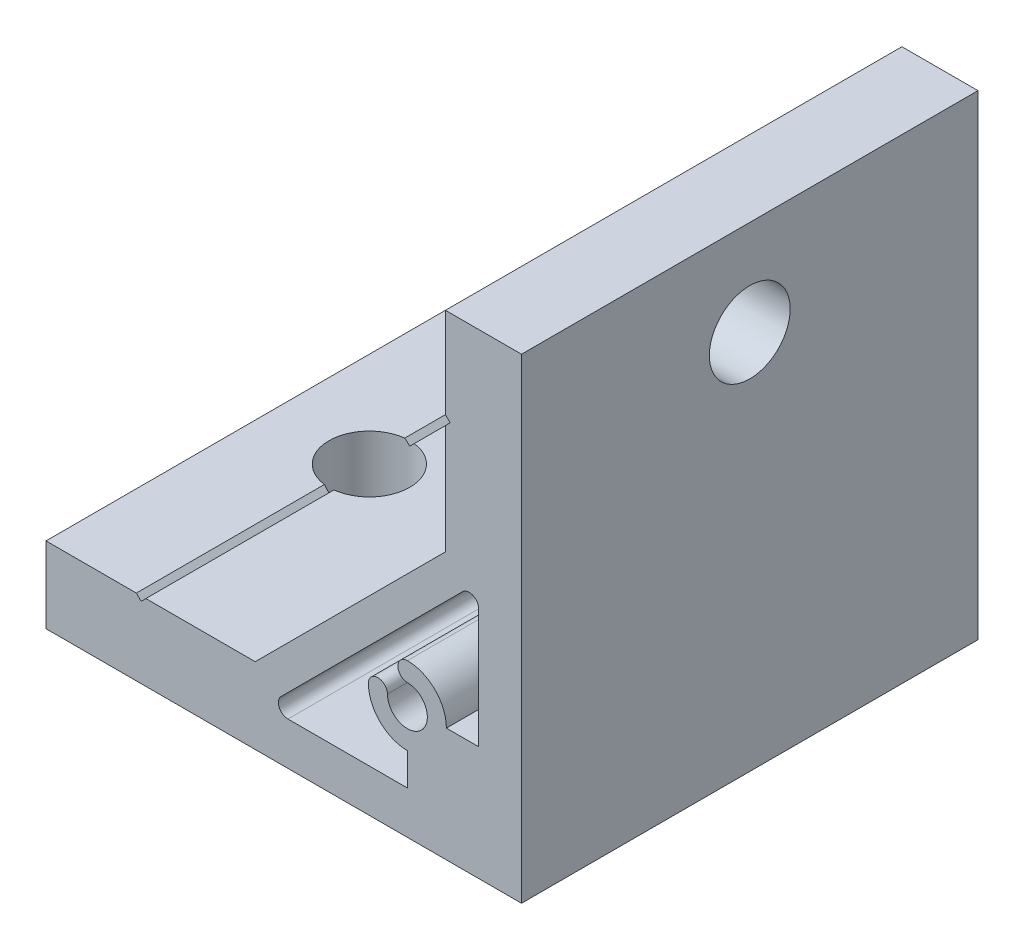
ISO-10303-21;
HEADER;
FILE_DESCRIPTION(('STEP AP214'),'2;1');
FILE_NAME('part.step','',(''),(''),'','','');
FILE_SCHEMA(('AUTOMOTIVE_DESIGN { 1 0 10303 214 1 1 1 1 }'));
ENDSEC;
DATA;
#1=APPLICATION_CONTEXT('core data for automotive mechanical design processes');
#2=APPLICATION_PROTOCOL_DEFINITION('international standard','automotive_design',2000,#1);
#3=PRODUCT_CONTEXT('',#1,'mechanical');
#4=PRODUCT('Part','Part','',(#3));
#5=PRODUCT_RELATED_PRODUCT_CATEGORY('part','',(#4));
#6=PRODUCT_DEFINITION_FORMATION('','',#4);
#7=PRODUCT_DEFINITION_CONTEXT('part definition',#1,'design');
#8=PRODUCT_DEFINITION('design','',#6,#7);
#9=PRODUCT_DEFINITION_SHAPE('','',#8);
#10=(LENGTH_UNIT() NAMED_UNIT(*) SI_UNIT(.MILLI.,.METRE.));
#11=(NAMED_UNIT(*) PLANE_ANGLE_UNIT() SI_UNIT($,.RADIAN.));
#12=(NAMED_UNIT(*) SI_UNIT($,.STERADIAN.) SOLID_ANGLE_UNIT());
#13=UNCERTAINTY_MEASURE_WITH_UNIT(LENGTH_MEASURE(1.E-05),#10,'distance_accuracy_value','');
#14=(GEOMETRIC_REPRESENTATION_CONTEXT(3) GLOBAL_UNCERTAINTY_ASSIGNED_CONTEXT((#13)) GLOBAL_UNIT_ASSIGNED_CONTEXT((#10,
#11,#12)) REPRESENTATION_CONTEXT('',''));
#15=CARTESIAN_POINT('',(0.,0.,0.));
#16=DIRECTION('',(0.,0.,1.));
#17=DIRECTION('',(1.,0.,0.));
#18=AXIS2_PLACEMENT_3D('',#15,#16,#17);
#19=CARTESIAN_POINT('',(-39.5,8.00000000000008,24.));
#20=DIRECTION('',(0.707106781186548,-0.707106781186548,0.));
#21=DIRECTION('',(0.707106781186548,0.707106781186548,0.));
#22=AXIS2_PLACEMENT_3D('',#19,#20,#21);
#23=PLANE('',#22);
#24=DIRECTION('',(0.,0.,-1.));
#25=VECTOR('',#24,1.);
#26=CARTESIAN_POINT('',(-39.5,8.00000000000008,24.));
#27=LINE('',#26,#25);
#28=CARTESIAN_POINT('',(-39.5,8.00000000000008,24.));
#29=VERTEX_POINT('',#28);
#30=CARTESIAN_POINT('',(-39.5,8.00000000000009,4.22048575403354));
#31=VERTEX_POINT('',#30);
#32=EDGE_CURVE('E264',#29,#31,#27,.T.);
#33=ORIENTED_EDGE('',*,*,#32,.T.);
#34=CARTESIAN_POINT('',(-40.,7.50000000000008,0.));
#35=DIRECTION('',(0.707106781186548,-0.707106781186548,0.));
#36=DIRECTION('',(0.707106781186548,0.707106781186548,0.));
#37=AXIS2_PLACEMENT_3D('',#34,#35,#36);
#38=ELLIPSE('',#37,6.01040764008561,4.25000000000001);
#39=CARTESIAN_POINT('',(-40.,7.50000000000008,4.25000000000002));
#40=VERTEX_POINT('',#39);
#41=EDGE_CURVE('E249',#31,#40,#38,.T.);
#42=ORIENTED_EDGE('',*,*,#41,.T.);
#43=DIRECTION('',(0.,0.,-1.));
#44=VECTOR('',#43,1.);
#45=CARTESIAN_POINT('',(-40.,7.50000000000008,24.));
#46=LINE('',#45,#44);
#47=CARTESIAN_POINT('',(-40.,7.50000000000008,24.));
#48=VERTEX_POINT('',#47);
#49=EDGE_CURVE('E248',#48,#40,#46,.T.);
#50=ORIENTED_EDGE('',*,*,#49,.F.);
#51=DIRECTION('',(-0.707106781186547,-0.707106781186547,0.));
#52=VECTOR('',#51,1.);
#53=CARTESIAN_POINT('',(-39.5,8.00000000000008,24.));
#54=LINE('',#53,#52);
#55=EDGE_CURVE('E365',#29,#48,#54,.T.);
#56=ORIENTED_EDGE('',*,*,#55,.F.);
#57=EDGE_LOOP('',(#33,#42,#50,#56));
#58=FACE_BOUND('',#57,.T.);
#59=ADVANCED_FACE('F34',(#58),#23,.F.);
#60=CARTESIAN_POINT('',(-40.,7.50000000000008,24.));
#61=DIRECTION('',(-0.707106781186549,-0.707106781186546,0.));
#62=DIRECTION('',(0.707106781186546,-0.707106781186549,0.));
#63=AXIS2_PLACEMENT_3D('',#60,#61,#62);
#64=PLANE('',#63);
#65=DIRECTION('',(0.,0.,-1.));
#66=VECTOR('',#65,1.);
#67=CARTESIAN_POINT('',(-40.5,8.00000000000008,24.));
#68=LINE('',#67,#66);
#69=CARTESIAN_POINT('',(-40.5,8.00000000000008,-4.22048575403354));
#70=VERTEX_POINT('',#69);
#71=CARTESIAN_POINT('',(-40.5,8.00000000000008,-24.));
#72=VERTEX_POINT('',#71);
#73=EDGE_CURVE('E256',#70,#72,#68,.T.);
#74=ORIENTED_EDGE('',*,*,#73,.F.);
#75=CARTESIAN_POINT('',(-40.,7.50000000000007,0.));
#76=DIRECTION('',(-0.707106781186549,-0.707106781186546,0.));
#77=DIRECTION('',(-0.707106781186546,0.707106781186549,0.));
#78=AXIS2_PLACEMENT_3D('',#75,#76,#77);
#79=ELLIPSE('',#78,6.01040764008572,4.25000000000001);
#80=CARTESIAN_POINT('',(-40.,7.50000000000008,-4.25));
#81=VERTEX_POINT('',#80);
#82=EDGE_CURVE('E49',#70,#81,#79,.T.);
#83=ORIENTED_EDGE('',*,*,#82,.T.);
#84=CARTESIAN_POINT('',(-40.,7.50000000000008,-24.));
#85=VERTEX_POINT('',#84);
#86=EDGE_CURVE('E255',#81,#85,#46,.T.);
#87=ORIENTED_EDGE('',*,*,#86,.T.);
#88=DIRECTION('',(-0.707106781186546,0.707106781186549,0.));
#89=VECTOR('',#88,1.);
#90=CARTESIAN_POINT('',(-40.,7.50000000000008,-24.));
#91=LINE('',#90,#89);
#92=EDGE_CURVE('E332',#85,#72,#91,.T.);
#93=ORIENTED_EDGE('',*,*,#92,.T.);
#94=EDGE_LOOP('',(#74,#83,#87,#93));
#95=FACE_BOUND('',#94,.T.);
#96=ADVANCED_FACE('F414',(#95),#64,.F.);
#97=CARTESIAN_POINT('',(-8.00000000000042,40.5,24.));
#98=DIRECTION('',(0.707106781186549,0.707106781186546,0.));
#99=DIRECTION('',(-0.707106781186546,0.707106781186549,0.));
#100=AXIS2_PLACEMENT_3D('',#97,#98,#99);
#101=PLANE('',#100);
#102=DIRECTION('',(0.,0.,-1.));
#103=VECTOR('',#102,1.);
#104=CARTESIAN_POINT('',(-8.00000000000042,40.5,24.));
#105=LINE('',#104,#103);
#106=CARTESIAN_POINT('',(-8.00000000000042,40.5,24.));
#107=VERTEX_POINT('',#106);
#108=CARTESIAN_POINT('',(-8.00000000000042,40.5,4.22048575403354));
#109=VERTEX_POINT('',#108);
#110=EDGE_CURVE('E282',#107,#109,#105,.T.);
#111=ORIENTED_EDGE('',*,*,#110,.T.);
#112=CARTESIAN_POINT('',(-7.50000000000042,40.,0.));
#113=DIRECTION('',(0.707106781186549,0.707106781186546,0.));
#114=DIRECTION('',(-0.707106781186546,0.707106781186549,0.));
#115=AXIS2_PLACEMENT_3D('',#112,#113,#114);
#116=ELLIPSE('',#115,6.01040764008586,4.25);
#117=CARTESIAN_POINT('',(-7.50000000000042,40.,4.25000000000001));
#118=VERTEX_POINT('',#117);
#119=EDGE_CURVE('E452',#109,#118,#116,.T.);
#120=ORIENTED_EDGE('',*,*,#119,.T.);
#121=DIRECTION('',(0.,0.,-1.));
#122=VECTOR('',#121,1.);
#123=CARTESIAN_POINT('',(-7.50000000000042,40.,24.));
#124=LINE('',#123,#122);
#125=CARTESIAN_POINT('',(-7.50000000000042,40.,24.));
#126=VERTEX_POINT('',#125);
#127=EDGE_CURVE('E278',#126,#118,#124,.T.);
#128=ORIENTED_EDGE('',*,*,#127,.F.);
#129=DIRECTION('',(0.707106781186546,-0.707106781186549,0.));
#130=VECTOR('',#129,1.);
#131=CARTESIAN_POINT('',(-8.00000000000042,40.5,24.));
#132=LINE('',#131,#130);
#133=EDGE_CURVE('E355',#107,#126,#132,.T.);
#134=ORIENTED_EDGE('',*,*,#133,.F.);
#135=EDGE_LOOP('',(#111,#120,#128,#134));
#136=FACE_BOUND('',#135,.T.);
#137=ADVANCED_FACE('F421',(#136),#101,.F.);
#138=CARTESIAN_POINT('',(-7.50000000000042,40.,24.));
#139=DIRECTION('',(0.707106781186549,-0.707106781186546,0.));
#140=DIRECTION('',(0.707106781186546,0.707106781186549,0.));
#141=AXIS2_PLACEMENT_3D('',#138,#139,#140);
#142=PLANE('',#141);
#143=DIRECTION('',(0.,0.,-1.));
#144=VECTOR('',#143,1.);
#145=CARTESIAN_POINT('',(-8.00000000000042,39.5,24.));
#146=LINE('',#145,#144);
#147=CARTESIAN_POINT('',(-8.00000000000042,39.5,-4.22048575403353));
#148=VERTEX_POINT('',#147);
#149=CARTESIAN_POINT('',(-8.00000000000042,39.5,-24.));
#150=VERTEX_POINT('',#149);
#151=EDGE_CURVE('E273',#148,#150,#146,.T.);
#152=ORIENTED_EDGE('',*,*,#151,.F.);
#153=CARTESIAN_POINT('',(-7.50000000000043,40.,0.));
#154=DIRECTION('',(0.707106781186549,-0.707106781186546,0.));
#155=DIRECTION('',(-0.707106781186546,-0.707106781186549,0.));
#156=AXIS2_PLACEMENT_3D('',#153,#154,#155);
#157=ELLIPSE('',#156,6.01040764008544,4.25);
#158=CARTESIAN_POINT('',(-7.50000000000042,40.,-4.24999999999999));
#159=VERTEX_POINT('',#158);
#160=EDGE_CURVE('E56',#148,#159,#157,.T.);
#161=ORIENTED_EDGE('',*,*,#160,.T.);
#162=CARTESIAN_POINT('',(-7.50000000000042,40.,-24.));
#163=VERTEX_POINT('',#162);
#164=EDGE_CURVE('E277',#159,#163,#124,.T.);
#165=ORIENTED_EDGE('',*,*,#164,.T.);
#166=DIRECTION('',(-0.707106781186546,-0.707106781186549,0.));
#167=VECTOR('',#166,1.);
#168=CARTESIAN_POINT('',(-7.50000000000042,40.,-24.));
#169=LINE('',#168,#167);
#170=EDGE_CURVE('E307',#163,#150,#169,.T.);
#171=ORIENTED_EDGE('',*,*,#170,.T.);
#172=EDGE_LOOP('',(#152,#161,#165,#171));
#173=FACE_BOUND('',#172,.T.);
#174=ADVANCED_FACE('F304',(#173),#142,.F.);
#175=CARTESIAN_POINT('',(0.,0.,24.));
#176=DIRECTION('',(0.,0.,1.));
#177=DIRECTION('',(1.,0.,0.));
#178=AXIS2_PLACEMENT_3D('',#175,#176,#177);
#179=PLANE('',#178);
#180=DIRECTION('',(0.,-1.,0.));
#181=VECTOR('',#180,1.);
#182=CARTESIAN_POINT('',(-50.,8.,24.));
#183=LINE('',#182,#181);
#184=CARTESIAN_POINT('',(-50.,8.,24.));
#185=VERTEX_POINT('',#184);
#186=CARTESIAN_POINT('',(-50.,0.,24.));
#187=VERTEX_POINT('',#186);
#188=EDGE_CURVE('E335',#185,#187,#183,.T.);
#189=ORIENTED_EDGE('',*,*,#188,.T.);
#190=DIRECTION('',(1.,0.,0.));
#191=VECTOR('',#190,1.);
#192=CARTESIAN_POINT('',(-50.,0.,24.));
#193=LINE('',#192,#191);
#194=CARTESIAN_POINT('',(0.,0.,24.));
#195=VERTEX_POINT('',#194);
#196=EDGE_CURVE('E339',#187,#195,#193,.T.);
#197=ORIENTED_EDGE('',*,*,#196,.T.);
#198=DIRECTION('',(0.,1.,0.));
#199=VECTOR('',#198,1.);
#200=CARTESIAN_POINT('',(0.,0.,24.));
#201=LINE('',#200,#199);
#202=CARTESIAN_POINT('',(0.,50.,24.));
#203=VERTEX_POINT('',#202);
#204=EDGE_CURVE('E344',#195,#203,#201,.T.);
#205=ORIENTED_EDGE('',*,*,#204,.T.);
#206=DIRECTION('',(-1.,0.,0.));
#207=VECTOR('',#206,1.);
#208=CARTESIAN_POINT('',(0.,50.,24.));
#209=LINE('',#208,#207);
#210=CARTESIAN_POINT('',(-8.00000000000009,50.,24.));
#211=VERTEX_POINT('',#210);
#212=EDGE_CURVE('E351',#203,#211,#209,.T.);
#213=ORIENTED_EDGE('',*,*,#212,.T.);
#214=DIRECTION('',(0.,-1.,0.));
#215=VECTOR('',#214,1.);
#216=CARTESIAN_POINT('',(-8.00000000000009,50.,24.));
#217=LINE('',#216,#215);
#218=EDGE_CURVE('E353',#211,#107,#217,.T.);
#219=ORIENTED_EDGE('',*,*,#218,.T.);
#220=ORIENTED_EDGE('',*,*,#133,.T.);
#221=DIRECTION('',(-0.707106781186546,-0.707106781186549,0.));
#222=VECTOR('',#221,1.);
#223=CARTESIAN_POINT('',(-7.50000000000042,40.,24.));
#224=LINE('',#223,#222);
#225=CARTESIAN_POINT('',(-8.00000000000042,39.5,24.));
#226=VERTEX_POINT('',#225);
#227=EDGE_CURVE('E357',#126,#226,#224,.T.);
#228=ORIENTED_EDGE('',*,*,#227,.T.);
#229=DIRECTION('',(0.,-1.,0.));
#230=VECTOR('',#229,1.);
#231=CARTESIAN_POINT('',(-8.00000000000042,39.5,24.));
#232=LINE('',#231,#230);
#233=CARTESIAN_POINT('',(-8.00000000000017,28.,24.));
#234=VERTEX_POINT('',#233);
#235=EDGE_CURVE('E359',#226,#234,#232,.T.);
#236=ORIENTED_EDGE('',*,*,#235,.T.);
#237=DIRECTION('',(-0.707106781186546,-0.707106781186549,0.));
#238=VECTOR('',#237,1.);
#239=CARTESIAN_POINT('',(-8.00000000000017,28.,24.));
#240=LINE('',#239,#238);
#241=CARTESIAN_POINT('',(-28.,8.00000000000008,24.));
#242=VERTEX_POINT('',#241);
#243=EDGE_CURVE('E361',#234,#242,#240,.T.);
#244=ORIENTED_EDGE('',*,*,#243,.T.);
#245=DIRECTION('',(-1.,0.,0.));
#246=VECTOR('',#245,1.);
#247=CARTESIAN_POINT('',(-28.,8.00000000000008,24.));
#248=LINE('',#247,#246);
#249=EDGE_CURVE('E363',#242,#29,#248,.T.);
#250=ORIENTED_EDGE('',*,*,#249,.T.);
#251=ORIENTED_EDGE('',*,*,#55,.T.);
#252=DIRECTION('',(-0.707106781186546,0.707106781186549,0.));
#253=VECTOR('',#252,1.);
#254=CARTESIAN_POINT('',(-40.,7.50000000000008,24.));
#255=LINE('',#254,#253);
#256=CARTESIAN_POINT('',(-40.5,8.00000000000008,24.));
#257=VERTEX_POINT('',#256);
#258=EDGE_CURVE('E367',#48,#257,#255,.T.);
#259=ORIENTED_EDGE('',*,*,#258,.T.);
#260=DIRECTION('',(-1.,0.,0.));
#261=VECTOR('',#260,1.);
#262=CARTESIAN_POINT('',(-40.5,8.00000000000008,24.));
#263=LINE('',#262,#261);
#264=EDGE_CURVE('E254',#257,#185,#263,.T.);
#265=ORIENTED_EDGE('',*,*,#264,.T.);
#266=EDGE_LOOP('',(#189,#197,#205,#213,#219,#220,#228,#236,#244,#250,#251,#259,#265));
#267=FACE_BOUND('',#266,.T.);
#268=DIRECTION('',(0.,1.,0.));
#269=VECTOR('',#268,1.);
#270=CARTESIAN_POINT('',(-4.5,12.,24.));
#271=LINE('',#270,#269);
#272=CARTESIAN_POINT('',(-4.5,12.,24.));
#273=VERTEX_POINT('',#272);
#274=CARTESIAN_POINT('',(-4.5,24.5603030380332,24.));
#275=VERTEX_POINT('',#274);
#276=EDGE_CURVE('E458',#273,#275,#271,.T.);
#277=ORIENTED_EDGE('',*,*,#276,.F.);
#278=DIRECTION('',(1.,0.,0.));
#279=VECTOR('',#278,1.);
#280=CARTESIAN_POINT('',(-7.9,12.,24.));
#281=LINE('',#280,#279);
#282=CARTESIAN_POINT('',(-7.9,12.,24.));
#283=VERTEX_POINT('',#282);
#284=EDGE_CURVE('E456',#283,#273,#281,.T.);
#285=ORIENTED_EDGE('',*,*,#284,.F.);
#286=CARTESIAN_POINT('',(-12.,12.,24.));
#287=DIRECTION('',(0.,0.,-1.));
#288=DIRECTION('',(-1.,0.,0.));
#289=AXIS2_PLACEMENT_3D('',#286,#287,#288);
#290=CIRCLE('',#289,4.1);
#291=CARTESIAN_POINT('',(-12.,16.1,24.));
#292=VERTEX_POINT('',#291);
#293=EDGE_CURVE('E480',#292,#283,#290,.T.);
#294=ORIENTED_EDGE('',*,*,#293,.F.);
#295=CARTESIAN_POINT('',(-12.,15.1,24.));
#296=DIRECTION('',(0.,0.,-1.));
#297=DIRECTION('',(-1.,0.,0.));
#298=AXIS2_PLACEMENT_3D('',#295,#296,#297);
#299=CIRCLE('',#298,1.);
#300=CARTESIAN_POINT('',(-12.,14.1,24.));
#301=VERTEX_POINT('',#300);
#302=EDGE_CURVE('E477',#301,#292,#299,.T.);
#303=ORIENTED_EDGE('',*,*,#302,.F.);
#304=CARTESIAN_POINT('',(-12.,12.,24.));
#305=DIRECTION('',(0.,0.,1.));
#306=DIRECTION('',(1.,0.,0.));
#307=AXIS2_PLACEMENT_3D('',#304,#305,#306);
#308=CIRCLE('',#307,2.1);
#309=CARTESIAN_POINT('',(-14.1,12.,24.));
#310=VERTEX_POINT('',#309);
#311=EDGE_CURVE('E475',#310,#301,#308,.T.);
#312=ORIENTED_EDGE('',*,*,#311,.F.);
#313=CARTESIAN_POINT('',(-15.1,12.,24.));
#314=DIRECTION('',(0.,0.,-1.));
#315=DIRECTION('',(-1.,0.,0.));
#316=AXIS2_PLACEMENT_3D('',#313,#314,#315);
#317=CIRCLE('',#316,1.);
#318=CARTESIAN_POINT('',(-16.1,12.,24.));
#319=VERTEX_POINT('',#318);
#320=EDGE_CURVE('E473',#319,#310,#317,.T.);
#321=ORIENTED_EDGE('',*,*,#320,.F.);
#322=CARTESIAN_POINT('',(-12.,12.,24.));
#323=DIRECTION('',(0.,0.,-1.));
#324=DIRECTION('',(-1.,0.,0.));
#325=AXIS2_PLACEMENT_3D('',#322,#323,#324);
#326=CIRCLE('',#325,4.1);
#327=CARTESIAN_POINT('',(-12.,7.9,24.));
#328=VERTEX_POINT('',#327);
#329=EDGE_CURVE('E471',#328,#319,#326,.T.);
#330=ORIENTED_EDGE('',*,*,#329,.F.);
#331=DIRECTION('',(0.,1.,0.));
#332=VECTOR('',#331,1.);
#333=CARTESIAN_POINT('',(-12.,4.5,24.));
#334=LINE('',#333,#332);
#335=CARTESIAN_POINT('',(-12.,4.5,24.));
#336=VERTEX_POINT('',#335);
#337=EDGE_CURVE('E469',#336,#328,#334,.T.);
#338=ORIENTED_EDGE('',*,*,#337,.F.);
#339=DIRECTION('',(1.,0.,0.));
#340=VECTOR('',#339,1.);
#341=CARTESIAN_POINT('',(-24.5603030380331,4.5,24.));
#342=LINE('',#341,#340);
#343=CARTESIAN_POINT('',(-24.5603030380331,4.5,24.));
#344=VERTEX_POINT('',#343);
#345=EDGE_CURVE('E467',#344,#336,#342,.T.);
#346=ORIENTED_EDGE('',*,*,#345,.F.);
#347=CARTESIAN_POINT('',(-24.5603030380331,5.5,24.));
#348=DIRECTION('',(0.,0.,1.));
#349=DIRECTION('',(1.,0.,0.));
#350=AXIS2_PLACEMENT_3D('',#347,#348,#349);
#351=CIRCLE('',#350,1.);
#352=CARTESIAN_POINT('',(-25.2674098192196,6.20710678118655,24.));
#353=VERTEX_POINT('',#352);
#354=EDGE_CURVE('E465',#353,#344,#351,.T.);
#355=ORIENTED_EDGE('',*,*,#354,.F.);
#356=DIRECTION('',(-0.707106781186546,-0.707106781186549,0.));
#357=VECTOR('',#356,1.);
#358=CARTESIAN_POINT('',(-6.20710678118655,25.2674098192197,24.));
#359=LINE('',#358,#357);
#360=CARTESIAN_POINT('',(-6.20710678118655,25.2674098192197,24.));
#361=VERTEX_POINT('',#360);
#362=EDGE_CURVE('E463',#361,#353,#359,.T.);
#363=ORIENTED_EDGE('',*,*,#362,.F.);
#364=CARTESIAN_POINT('',(-5.5,24.5603030380332,24.));
#365=DIRECTION('',(0.,0.,1.));
#366=DIRECTION('',(1.,0.,0.));
#367=AXIS2_PLACEMENT_3D('',#364,#365,#366);
#368=CIRCLE('',#367,0.999999999999999);
#369=EDGE_CURVE('E461',#275,#361,#368,.T.);
#370=ORIENTED_EDGE('',*,*,#369,.F.);
#371=EDGE_LOOP('',(#277,#285,#294,#303,#312,#321,#330,#338,#346,#355,#363,#370));
#372=FACE_BOUND('',#371,.T.);
#373=ADVANCED_FACE('F411',(#267,#372),#179,.T.);
#374=CARTESIAN_POINT('',(0.,0.,-24.));
#375=DIRECTION('',(0.,0.,1.));
#376=DIRECTION('',(1.,0.,0.));
#377=AXIS2_PLACEMENT_3D('',#374,#375,#376);
#378=PLANE('',#377);
#379=DIRECTION('',(0.,-1.,0.));
#380=VECTOR('',#379,1.);
#381=CARTESIAN_POINT('',(-50.,8.,-24.));
#382=LINE('',#381,#380);
#383=CARTESIAN_POINT('',(-50.,8.,-24.));
#384=VERTEX_POINT('',#383);
#385=CARTESIAN_POINT('',(-50.,0.,-24.));
#386=VERTEX_POINT('',#385);
#387=EDGE_CURVE('E370',#384,#386,#382,.T.);
#388=ORIENTED_EDGE('',*,*,#387,.F.);
#389=DIRECTION('',(-1.,0.,0.));
#390=VECTOR('',#389,1.);
#391=CARTESIAN_POINT('',(-40.5,8.00000000000008,-24.));
#392=LINE('',#391,#390);
#393=EDGE_CURVE('E334',#72,#384,#392,.T.);
#394=ORIENTED_EDGE('',*,*,#393,.F.);
#395=ORIENTED_EDGE('',*,*,#92,.F.);
#396=DIRECTION('',(-0.707106781186547,-0.707106781186547,0.));
#397=VECTOR('',#396,1.);
#398=CARTESIAN_POINT('',(-39.5,8.00000000000008,-24.));
#399=LINE('',#398,#397);
#400=CARTESIAN_POINT('',(-39.5,8.00000000000008,-24.));
#401=VERTEX_POINT('',#400);
#402=EDGE_CURVE('E329',#401,#85,#399,.T.);
#403=ORIENTED_EDGE('',*,*,#402,.F.);
#404=DIRECTION('',(-1.,0.,0.));
#405=VECTOR('',#404,1.);
#406=CARTESIAN_POINT('',(-28.,8.00000000000008,-24.));
#407=LINE('',#406,#405);
#408=CARTESIAN_POINT('',(-28.,8.00000000000008,-24.));
#409=VERTEX_POINT('',#408);
#410=EDGE_CURVE('E323',#409,#401,#407,.T.);
#411=ORIENTED_EDGE('',*,*,#410,.F.);
#412=DIRECTION('',(-0.707106781186546,-0.707106781186549,0.));
#413=VECTOR('',#412,1.);
#414=CARTESIAN_POINT('',(-8.00000000000017,28.,-24.));
#415=LINE('',#414,#413);
#416=CARTESIAN_POINT('',(-8.00000000000017,28.,-24.));
#417=VERTEX_POINT('',#416);
#418=EDGE_CURVE('E320',#417,#409,#415,.T.);
#419=ORIENTED_EDGE('',*,*,#418,.F.);
#420=DIRECTION('',(0.,-1.,0.));
#421=VECTOR('',#420,1.);
#422=CARTESIAN_POINT('',(-8.00000000000042,39.5,-24.));
#423=LINE('',#422,#421);
#424=EDGE_CURVE('E312',#150,#417,#423,.T.);
#425=ORIENTED_EDGE('',*,*,#424,.F.);
#426=ORIENTED_EDGE('',*,*,#170,.F.);
#427=DIRECTION('',(0.707106781186546,-0.707106781186549,0.));
#428=VECTOR('',#427,1.);
#429=CARTESIAN_POINT('',(-8.00000000000042,40.5,-24.));
#430=LINE('',#429,#428);
#431=CARTESIAN_POINT('',(-8.00000000000042,40.5,-24.));
#432=VERTEX_POINT('',#431);
#433=EDGE_CURVE('E313',#432,#163,#430,.T.);
#434=ORIENTED_EDGE('',*,*,#433,.F.);
#435=DIRECTION('',(0.,-1.,0.));
#436=VECTOR('',#435,1.);
#437=CARTESIAN_POINT('',(-8.00000000000009,50.,-24.));
#438=LINE('',#437,#436);
#439=CARTESIAN_POINT('',(-8.00000000000009,50.,-24.));
#440=VERTEX_POINT('',#439);
#441=EDGE_CURVE('E379',#440,#432,#438,.T.);
#442=ORIENTED_EDGE('',*,*,#441,.F.);
#443=DIRECTION('',(-1.,0.,0.));
#444=VECTOR('',#443,1.);
#445=CARTESIAN_POINT('',(0.,50.,-24.));
#446=LINE('',#445,#444);
#447=CARTESIAN_POINT('',(0.,50.,-24.));
#448=VERTEX_POINT('',#447);
#449=EDGE_CURVE('E377',#448,#440,#446,.T.);
#450=ORIENTED_EDGE('',*,*,#449,.F.);
#451=DIRECTION('',(0.,1.,0.));
#452=VECTOR('',#451,1.);
#453=CARTESIAN_POINT('',(0.,0.,-24.));
#454=LINE('',#453,#452);
#455=CARTESIAN_POINT('',(0.,0.,-24.));
#456=VERTEX_POINT('',#455);
#457=EDGE_CURVE('E375',#456,#448,#454,.T.);
#458=ORIENTED_EDGE('',*,*,#457,.F.);
#459=DIRECTION('',(1.,0.,0.));
#460=VECTOR('',#459,1.);
#461=CARTESIAN_POINT('',(-50.,0.,-24.));
#462=LINE('',#461,#460);
#463=EDGE_CURVE('E373',#386,#456,#462,.T.);
#464=ORIENTED_EDGE('',*,*,#463,.F.);
#465=EDGE_LOOP('',(#388,#394,#395,#403,#411,#419,#425,#426,#434,#442,#450,#458,#464));
#466=FACE_BOUND('',#465,.T.);
#467=DIRECTION('',(1.,0.,0.));
#468=VECTOR('',#467,1.);
#469=CARTESIAN_POINT('',(-7.9,12.,-24.));
#470=LINE('',#469,#468);
#471=CARTESIAN_POINT('',(-7.9,12.,-24.));
#472=VERTEX_POINT('',#471);
#473=CARTESIAN_POINT('',(-4.5,12.,-24.));
#474=VERTEX_POINT('',#473);
#475=EDGE_CURVE('E483',#472,#474,#470,.T.);
#476=ORIENTED_EDGE('',*,*,#475,.T.);
#477=DIRECTION('',(0.,1.,0.));
#478=VECTOR('',#477,1.);
#479=CARTESIAN_POINT('',(-4.5,12.,-24.));
#480=LINE('',#479,#478);
#481=CARTESIAN_POINT('',(-4.5,24.5603030380332,-24.));
#482=VERTEX_POINT('',#481);
#483=EDGE_CURVE('E486',#474,#482,#480,.T.);
#484=ORIENTED_EDGE('',*,*,#483,.T.);
#485=CARTESIAN_POINT('',(-5.5,24.5603030380332,-24.));
#486=DIRECTION('',(0.,0.,1.));
#487=DIRECTION('',(1.,0.,0.));
#488=AXIS2_PLACEMENT_3D('',#485,#486,#487);
#489=CIRCLE('',#488,0.999999999999999);
#490=CARTESIAN_POINT('',(-6.20710678118655,25.2674098192197,-24.));
#491=VERTEX_POINT('',#490);
#492=EDGE_CURVE('E489',#482,#491,#489,.T.);
#493=ORIENTED_EDGE('',*,*,#492,.T.);
#494=DIRECTION('',(-0.707106781186546,-0.707106781186549,0.));
#495=VECTOR('',#494,1.);
#496=CARTESIAN_POINT('',(-6.20710678118655,25.2674098192197,-24.));
#497=LINE('',#496,#495);
#498=CARTESIAN_POINT('',(-25.2674098192196,6.20710678118655,-24.));
#499=VERTEX_POINT('',#498);
#500=EDGE_CURVE('E492',#491,#499,#497,.T.);
#501=ORIENTED_EDGE('',*,*,#500,.T.);
#502=CARTESIAN_POINT('',(-24.5603030380331,5.5,-24.));
#503=DIRECTION('',(0.,0.,1.));
#504=DIRECTION('',(1.,0.,0.));
#505=AXIS2_PLACEMENT_3D('',#502,#503,#504);
#506=CIRCLE('',#505,1.);
#507=CARTESIAN_POINT('',(-24.5603030380331,4.5,-24.));
#508=VERTEX_POINT('',#507);
#509=EDGE_CURVE('E495',#499,#508,#506,.T.);
#510=ORIENTED_EDGE('',*,*,#509,.T.);
#511=DIRECTION('',(1.,0.,0.));
#512=VECTOR('',#511,1.);
#513=CARTESIAN_POINT('',(-24.5603030380331,4.5,-24.));
#514=LINE('',#513,#512);
#515=CARTESIAN_POINT('',(-12.,4.5,-24.));
#516=VERTEX_POINT('',#515);
#517=EDGE_CURVE('E498',#508,#516,#514,.T.);
#518=ORIENTED_EDGE('',*,*,#517,.T.);
#519=DIRECTION('',(0.,1.,0.));
#520=VECTOR('',#519,1.);
#521=CARTESIAN_POINT('',(-12.,4.5,-24.));
#522=LINE('',#521,#520);
#523=CARTESIAN_POINT('',(-12.,7.9,-24.));
#524=VERTEX_POINT('',#523);
#525=EDGE_CURVE('E501',#516,#524,#522,.T.);
#526=ORIENTED_EDGE('',*,*,#525,.T.);
#527=CARTESIAN_POINT('',(-12.,12.,-24.));
#528=DIRECTION('',(0.,0.,-1.));
#529=DIRECTION('',(-1.,0.,0.));
#530=AXIS2_PLACEMENT_3D('',#527,#528,#529);
#531=CIRCLE('',#530,4.1);
#532=CARTESIAN_POINT('',(-16.1,12.,-24.));
#533=VERTEX_POINT('',#532);
#534=EDGE_CURVE('E504',#524,#533,#531,.T.);
#535=ORIENTED_EDGE('',*,*,#534,.T.);
#536=CARTESIAN_POINT('',(-15.1,12.,-24.));
#537=DIRECTION('',(0.,0.,-1.));
#538=DIRECTION('',(-1.,0.,0.));
#539=AXIS2_PLACEMENT_3D('',#536,#537,#538);
#540=CIRCLE('',#539,1.);
#541=CARTESIAN_POINT('',(-14.1,12.,-24.));
#542=VERTEX_POINT('',#541);
#543=EDGE_CURVE('E507',#533,#542,#540,.T.);
#544=ORIENTED_EDGE('',*,*,#543,.T.);
#545=CARTESIAN_POINT('',(-12.,12.,-24.));
#546=DIRECTION('',(0.,0.,1.));
#547=DIRECTION('',(1.,0.,0.));
#548=AXIS2_PLACEMENT_3D('',#545,#546,#547);
#549=CIRCLE('',#548,2.1);
#550=CARTESIAN_POINT('',(-12.,14.1,-24.));
#551=VERTEX_POINT('',#550);
#552=EDGE_CURVE('E510',#542,#551,#549,.T.);
#553=ORIENTED_EDGE('',*,*,#552,.T.);
#554=CARTESIAN_POINT('',(-12.,15.1,-24.));
#555=DIRECTION('',(0.,0.,-1.));
#556=DIRECTION('',(-1.,0.,0.));
#557=AXIS2_PLACEMENT_3D('',#554,#555,#556);
#558=CIRCLE('',#557,1.);
#559=CARTESIAN_POINT('',(-12.,16.1,-24.));
#560=VERTEX_POINT('',#559);
#561=EDGE_CURVE('E513',#551,#560,#558,.T.);
#562=ORIENTED_EDGE('',*,*,#561,.T.);
#563=CARTESIAN_POINT('',(-12.,12.,-24.));
#564=DIRECTION('',(0.,0.,-1.));
#565=DIRECTION('',(-1.,0.,0.));
#566=AXIS2_PLACEMENT_3D('',#563,#564,#565);
#567=CIRCLE('',#566,4.1);
#568=EDGE_CURVE('E459',#560,#472,#567,.T.);
#569=ORIENTED_EDGE('',*,*,#568,.T.);
#570=EDGE_LOOP('',(#476,#484,#493,#501,#510,#518,#526,#535,#544,#553,#562,#569));
#571=FACE_BOUND('',#570,.T.);
#572=ADVANCED_FACE('F317',(#466,#571),#378,.F.);
#573=CARTESIAN_POINT('',(-50.,8.,24.));
#574=DIRECTION('',(1.,0.,0.));
#575=DIRECTION('',(0.,1.,0.));
#576=AXIS2_PLACEMENT_3D('',#573,#574,#575);
#577=PLANE('',#576);
#578=ORIENTED_EDGE('',*,*,#387,.T.);
#579=DIRECTION('',(0.,0.,-1.));
#580=VECTOR('',#579,1.);
#581=CARTESIAN_POINT('',(-50.,0.,24.));
#582=LINE('',#581,#580);
#583=EDGE_CURVE('E294',#187,#386,#582,.T.);
#584=ORIENTED_EDGE('',*,*,#583,.F.);
#585=ORIENTED_EDGE('',*,*,#188,.F.);
#586=DIRECTION('',(0.,0.,-1.));
#587=VECTOR('',#586,1.);
#588=CARTESIAN_POINT('',(-50.,8.,24.));
#589=LINE('',#588,#587);
#590=EDGE_CURVE('E259',#185,#384,#589,.T.);
#591=ORIENTED_EDGE('',*,*,#590,.T.);
#592=EDGE_LOOP('',(#578,#584,#585,#591));
#593=FACE_BOUND('',#592,.T.);
#594=ADVANCED_FACE('F36',(#593),#577,.F.);
#595=CARTESIAN_POINT('',(-50.,0.,24.));
#596=DIRECTION('',(0.,1.,0.));
#597=DIRECTION('',(-1.,0.,0.));
#598=AXIS2_PLACEMENT_3D('',#595,#596,#597);
#599=PLANE('',#598);
#600=CARTESIAN_POINT('',(-40.,-3.29597460435593E-13,0.));
#601=DIRECTION('',(0.,1.,0.));
#602=DIRECTION('',(-1.,0.,0.));
#603=AXIS2_PLACEMENT_3D('',#600,#601,#602);
#604=CIRCLE('',#603,4.25000000000001);
#605=CARTESIAN_POINT('',(-44.25,-3.64520183044074E-13,0.));
#606=VERTEX_POINT('',#605);
#607=EDGE_CURVE('E250',#606,#606,#604,.T.);
#608=ORIENTED_EDGE('',*,*,#607,.T.);
#609=EDGE_LOOP('',(#608));
#610=FACE_BOUND('',#609,.T.);
#611=ORIENTED_EDGE('',*,*,#463,.T.);
#612=DIRECTION('',(0.,0.,-1.));
#613=VECTOR('',#612,1.);
#614=CARTESIAN_POINT('',(0.,0.,24.));
#615=LINE('',#614,#613);
#616=EDGE_CURVE('E291',#195,#456,#615,.T.);
#617=ORIENTED_EDGE('',*,*,#616,.F.);
#618=ORIENTED_EDGE('',*,*,#196,.F.);
#619=ORIENTED_EDGE('',*,*,#583,.T.);
#620=EDGE_LOOP('',(#611,#617,#618,#619));
#621=FACE_BOUND('',#620,.T.);
#622=ADVANCED_FACE('F403',(#610,#621),#599,.F.);
#623=CARTESIAN_POINT('',(0.,0.,24.));
#624=DIRECTION('',(-1.,0.,0.));
#625=DIRECTION('',(0.,0.,1.));
#626=AXIS2_PLACEMENT_3D('',#623,#624,#625);
#627=PLANE('',#626);
#628=CARTESIAN_POINT('',(1.38777878078145E-12,39.9999999999998,0.));
#629=DIRECTION('',(-1.,0.,0.));
#630=DIRECTION('',(0.,-1.,0.));
#631=AXIS2_PLACEMENT_3D('',#628,#629,#630);
#632=CIRCLE('',#631,4.25);
#633=CARTESIAN_POINT('',(1.24032728532342E-12,35.7499999999998,0.));
#634=VERTEX_POINT('',#633);
#635=EDGE_CURVE('E446',#634,#634,#632,.T.);
#636=ORIENTED_EDGE('',*,*,#635,.T.);
#637=EDGE_LOOP('',(#636));
#638=FACE_BOUND('',#637,.T.);
#639=ORIENTED_EDGE('',*,*,#457,.T.);
#640=DIRECTION('',(0.,0.,-1.));
#641=VECTOR('',#640,1.);
#642=CARTESIAN_POINT('',(0.,50.,24.));
#643=LINE('',#642,#641);
#644=EDGE_CURVE('E288',#203,#448,#643,.T.);
#645=ORIENTED_EDGE('',*,*,#644,.F.);
#646=ORIENTED_EDGE('',*,*,#204,.F.);
#647=ORIENTED_EDGE('',*,*,#616,.T.);
#648=EDGE_LOOP('',(#639,#645,#646,#647));
#649=FACE_BOUND('',#648,.T.);
#650=ADVANCED_FACE('F400',(#638,#649),#627,.F.);
#651=CARTESIAN_POINT('',(0.,50.,24.));
#652=DIRECTION('',(0.,-1.,0.));
#653=DIRECTION('',(0.,0.,-1.));
#654=AXIS2_PLACEMENT_3D('',#651,#652,#653);
#655=PLANE('',#654);
#656=ORIENTED_EDGE('',*,*,#449,.T.);
#657=DIRECTION('',(0.,0.,-1.));
#658=VECTOR('',#657,1.);
#659=CARTESIAN_POINT('',(-8.00000000000009,50.,24.));
#660=LINE('',#659,#658);
#661=EDGE_CURVE('E285',#211,#440,#660,.T.);
#662=ORIENTED_EDGE('',*,*,#661,.F.);
#663=ORIENTED_EDGE('',*,*,#212,.F.);
#664=ORIENTED_EDGE('',*,*,#644,.T.);
#665=EDGE_LOOP('',(#656,#662,#663,#664));
#666=FACE_BOUND('',#665,.T.);
#667=ADVANCED_FACE('F396',(#666),#655,.F.);
#668=CARTESIAN_POINT('',(-8.00000000000009,50.,24.));
#669=DIRECTION('',(1.,0.,0.));
#670=DIRECTION('',(0.,1.,0.));
#671=AXIS2_PLACEMENT_3D('',#668,#669,#670);
#672=PLANE('',#671);
#673=CARTESIAN_POINT('',(-8.00000000000042,40.5,-4.22048575403354));
#674=VERTEX_POINT('',#673);
#675=EDGE_CURVE('E281',#674,#432,#105,.T.);
#676=ORIENTED_EDGE('',*,*,#675,.F.);
#677=CARTESIAN_POINT('',(-8.00000000000044,40.0000000000001,0.));
#678=DIRECTION('',(-1.,0.,0.));
#679=DIRECTION('',(0.,-1.,0.));
#680=AXIS2_PLACEMENT_3D('',#677,#678,#679);
#681=CIRCLE('',#680,4.25);
#682=EDGE_CURVE('E440',#109,#674,#681,.T.);
#683=ORIENTED_EDGE('',*,*,#682,.F.);
#684=ORIENTED_EDGE('',*,*,#110,.F.);
#685=ORIENTED_EDGE('',*,*,#218,.F.);
#686=ORIENTED_EDGE('',*,*,#661,.T.);
#687=ORIENTED_EDGE('',*,*,#441,.T.);
#688=EDGE_LOOP('',(#676,#683,#684,#685,#686,#687));
#689=FACE_BOUND('',#688,.T.);
#690=ADVANCED_FACE('F389',(#689),#672,.F.);
#691=ORIENTED_EDGE('',*,*,#164,.F.);
#692=EDGE_CURVE('E455',#159,#674,#116,.T.);
#693=ORIENTED_EDGE('',*,*,#692,.T.);
#694=ORIENTED_EDGE('',*,*,#675,.T.);
#695=ORIENTED_EDGE('',*,*,#433,.T.);
#696=EDGE_LOOP('',(#691,#693,#694,#695));
#697=FACE_BOUND('',#696,.T.);
#698=ADVANCED_FACE('F382',(#697),#101,.F.);
#699=ORIENTED_EDGE('',*,*,#127,.T.);
#700=CARTESIAN_POINT('',(-8.00000000000046,39.5,4.22048575403353));
#701=VERTEX_POINT('',#700);
#702=EDGE_CURVE('E449',#118,#701,#157,.T.);
#703=ORIENTED_EDGE('',*,*,#702,.T.);
#704=EDGE_CURVE('E274',#226,#701,#146,.T.);
#705=ORIENTED_EDGE('',*,*,#704,.F.);
#706=ORIENTED_EDGE('',*,*,#227,.F.);
#707=EDGE_LOOP('',(#699,#703,#705,#706));
#708=FACE_BOUND('',#707,.T.);
#709=ADVANCED_FACE('F706',(#708),#142,.F.);
#710=CARTESIAN_POINT('',(-8.00000000000042,39.5,24.));
#711=DIRECTION('',(1.,0.,0.));
#712=DIRECTION('',(0.,1.,0.));
#713=AXIS2_PLACEMENT_3D('',#710,#711,#712);
#714=PLANE('',#713);
#715=ORIENTED_EDGE('',*,*,#704,.T.);
#716=CARTESIAN_POINT('',(-8.00000000000043,40.0000000000001,0.));
#717=DIRECTION('',(1.,0.,0.));
#718=DIRECTION('',(0.,1.,0.));
#719=AXIS2_PLACEMENT_3D('',#716,#717,#718);
#720=CIRCLE('',#719,4.25);
#721=EDGE_CURVE('E42',#701,#148,#720,.T.);
#722=ORIENTED_EDGE('',*,*,#721,.T.);
#723=ORIENTED_EDGE('',*,*,#151,.T.);
#724=ORIENTED_EDGE('',*,*,#424,.T.);
#725=DIRECTION('',(0.,0.,-1.));
#726=VECTOR('',#725,1.);
#727=CARTESIAN_POINT('',(-8.00000000000017,28.,24.));
#728=LINE('',#727,#726);
#729=EDGE_CURVE('E270',#234,#417,#728,.T.);
#730=ORIENTED_EDGE('',*,*,#729,.F.);
#731=ORIENTED_EDGE('',*,*,#235,.F.);
#732=EDGE_LOOP('',(#715,#722,#723,#724,#730,#731));
#733=FACE_BOUND('',#732,.T.);
#734=ADVANCED_FACE('F298',(#733),#714,.F.);
#735=CARTESIAN_POINT('',(-8.00000000000017,28.,24.));
#736=DIRECTION('',(0.707106781186549,-0.707106781186546,0.));
#737=DIRECTION('',(0.707106781186546,0.707106781186549,0.));
#738=AXIS2_PLACEMENT_3D('',#735,#736,#737);
#739=PLANE('',#738);
#740=ORIENTED_EDGE('',*,*,#418,.T.);
#741=DIRECTION('',(0.,0.,-1.));
#742=VECTOR('',#741,1.);
#743=CARTESIAN_POINT('',(-28.,8.00000000000008,24.));
#744=LINE('',#743,#742);
#745=EDGE_CURVE('E267',#242,#409,#744,.T.);
#746=ORIENTED_EDGE('',*,*,#745,.F.);
#747=ORIENTED_EDGE('',*,*,#243,.F.);
#748=ORIENTED_EDGE('',*,*,#729,.T.);
#749=EDGE_LOOP('',(#740,#746,#747,#748));
#750=FACE_BOUND('',#749,.T.);
#751=ADVANCED_FACE('F432',(#750),#739,.F.);
#752=CARTESIAN_POINT('',(-28.,8.00000000000008,24.));
#753=DIRECTION('',(0.,-1.,0.));
#754=DIRECTION('',(1.,0.,0.));
#755=AXIS2_PLACEMENT_3D('',#752,#753,#754);
#756=PLANE('',#755);
#757=CARTESIAN_POINT('',(-39.5,8.00000000000009,-4.22048575403354));
#758=VERTEX_POINT('',#757);
#759=EDGE_CURVE('E263',#758,#401,#27,.T.);
#760=ORIENTED_EDGE('',*,*,#759,.F.);
#761=CARTESIAN_POINT('',(-40.,8.00000000000008,0.));
#762=DIRECTION('',(0.,1.,0.));
#763=DIRECTION('',(-1.,0.,0.));
#764=AXIS2_PLACEMENT_3D('',#761,#762,#763);
#765=CIRCLE('',#764,4.25000000000001);
#766=EDGE_CURVE('E443',#31,#758,#765,.T.);
#767=ORIENTED_EDGE('',*,*,#766,.F.);
#768=ORIENTED_EDGE('',*,*,#32,.F.);
#769=ORIENTED_EDGE('',*,*,#249,.F.);
#770=ORIENTED_EDGE('',*,*,#745,.T.);
#771=ORIENTED_EDGE('',*,*,#410,.T.);
#772=EDGE_LOOP('',(#760,#767,#768,#769,#770,#771));
#773=FACE_BOUND('',#772,.T.);
#774=ADVANCED_FACE('F426',(#773),#756,.F.);
#775=ORIENTED_EDGE('',*,*,#86,.F.);
#776=EDGE_CURVE('E436',#81,#758,#38,.T.);
#777=ORIENTED_EDGE('',*,*,#776,.T.);
#778=ORIENTED_EDGE('',*,*,#759,.T.);
#779=ORIENTED_EDGE('',*,*,#402,.T.);
#780=EDGE_LOOP('',(#775,#777,#778,#779));
#781=FACE_BOUND('',#780,.T.);
#782=ADVANCED_FACE('F417',(#781),#23,.F.);
#783=ORIENTED_EDGE('',*,*,#49,.T.);
#784=CARTESIAN_POINT('',(-40.5,8.00000000000008,4.22048575403354));
#785=VERTEX_POINT('',#784);
#786=EDGE_CURVE('E235',#40,#785,#79,.T.);
#787=ORIENTED_EDGE('',*,*,#786,.T.);
#788=EDGE_CURVE('E245',#257,#785,#68,.T.);
#789=ORIENTED_EDGE('',*,*,#788,.F.);
#790=ORIENTED_EDGE('',*,*,#258,.F.);
#791=EDGE_LOOP('',(#783,#787,#789,#790));
#792=FACE_BOUND('',#791,.T.);
#793=ADVANCED_FACE('F243',(#792),#64,.F.);
#794=CARTESIAN_POINT('',(-40.5,8.00000000000008,24.));
#795=DIRECTION('',(0.,-1.,0.));
#796=DIRECTION('',(1.,0.,0.));
#797=AXIS2_PLACEMENT_3D('',#794,#795,#796);
#798=PLANE('',#797);
#799=ORIENTED_EDGE('',*,*,#788,.T.);
#800=CARTESIAN_POINT('',(-40.,8.00000000000008,0.));
#801=DIRECTION('',(0.,-1.,0.));
#802=DIRECTION('',(1.,0.,0.));
#803=AXIS2_PLACEMENT_3D('',#800,#801,#802);
#804=CIRCLE('',#803,4.25000000000001);
#805=EDGE_CURVE('E11',#785,#70,#804,.T.);
#806=ORIENTED_EDGE('',*,*,#805,.T.);
#807=ORIENTED_EDGE('',*,*,#73,.T.);
#808=ORIENTED_EDGE('',*,*,#393,.T.);
#809=ORIENTED_EDGE('',*,*,#590,.F.);
#810=ORIENTED_EDGE('',*,*,#264,.F.);
#811=EDGE_LOOP('',(#799,#806,#807,#808,#809,#810));
#812=FACE_BOUND('',#811,.T.);
#813=ADVANCED_FACE('F252',(#812),#798,.F.);
#814=CARTESIAN_POINT('',(-7.9,12.,24.));
#815=DIRECTION('',(0.,1.,0.));
#816=DIRECTION('',(0.,0.,1.));
#817=AXIS2_PLACEMENT_3D('',#814,#815,#816);
#818=PLANE('',#817);
#819=ORIENTED_EDGE('',*,*,#475,.F.);
#820=DIRECTION('',(0.,0.,-1.));
#821=VECTOR('',#820,1.);
#822=CARTESIAN_POINT('',(-7.9,12.,24.));
#823=LINE('',#822,#821);
#824=EDGE_CURVE('E482',#283,#472,#823,.T.);
#825=ORIENTED_EDGE('',*,*,#824,.F.);
#826=ORIENTED_EDGE('',*,*,#284,.T.);
#827=DIRECTION('',(0.,0.,-1.));
#828=VECTOR('',#827,1.);
#829=CARTESIAN_POINT('',(-4.5,12.,24.));
#830=LINE('',#829,#828);
#831=EDGE_CURVE('E347',#273,#474,#830,.T.);
#832=ORIENTED_EDGE('',*,*,#831,.T.);
#833=EDGE_LOOP('',(#819,#825,#826,#832));
#834=FACE_BOUND('',#833,.T.);
#835=ADVANCED_FACE('F544',(#834),#818,.T.);
#836=CARTESIAN_POINT('',(-4.5,12.,24.));
#837=DIRECTION('',(-1.,0.,0.));
#838=DIRECTION('',(0.,-1.,0.));
#839=AXIS2_PLACEMENT_3D('',#836,#837,#838);
#840=PLANE('',#839);
#841=ORIENTED_EDGE('',*,*,#483,.F.);
#842=ORIENTED_EDGE('',*,*,#831,.F.);
#843=ORIENTED_EDGE('',*,*,#276,.T.);
#844=DIRECTION('',(0.,0.,-1.));
#845=VECTOR('',#844,1.);
#846=CARTESIAN_POINT('',(-4.5,24.5603030380332,24.));
#847=LINE('',#846,#845);
#848=EDGE_CURVE('E537',#275,#482,#847,.T.);
#849=ORIENTED_EDGE('',*,*,#848,.T.);
#850=EDGE_LOOP('',(#841,#842,#843,#849));
#851=FACE_BOUND('',#850,.T.);
#852=ADVANCED_FACE('F557',(#851),#840,.T.);
#853=CARTESIAN_POINT('',(-5.5,24.5603030380332,24.));
#854=DIRECTION('',(0.,0.,-1.));
#855=DIRECTION('',(-1.,0.,0.));
#856=AXIS2_PLACEMENT_3D('',#853,#854,#855);
#857=CYLINDRICAL_SURFACE('',#856,0.999999999999999);
#858=ORIENTED_EDGE('',*,*,#492,.F.);
#859=ORIENTED_EDGE('',*,*,#848,.F.);
#860=ORIENTED_EDGE('',*,*,#369,.T.);
#861=DIRECTION('',(0.,0.,-1.));
#862=VECTOR('',#861,1.);
#863=CARTESIAN_POINT('',(-6.20710678118655,25.2674098192197,24.));
#864=LINE('',#863,#862);
#865=EDGE_CURVE('E536',#361,#491,#864,.T.);
#866=ORIENTED_EDGE('',*,*,#865,.T.);
#867=EDGE_LOOP('',(#858,#859,#860,#866));
#868=FACE_BOUND('',#867,.T.);
#869=ADVANCED_FACE('F559',(#868),#857,.F.);
#870=CARTESIAN_POINT('',(-6.20710678118655,25.2674098192197,24.));
#871=DIRECTION('',(0.707106781186549,-0.707106781186546,0.));
#872=DIRECTION('',(0.707106781186546,0.707106781186549,0.));
#873=AXIS2_PLACEMENT_3D('',#870,#871,#872);
#874=PLANE('',#873);
#875=ORIENTED_EDGE('',*,*,#500,.F.);
#876=ORIENTED_EDGE('',*,*,#865,.F.);
#877=ORIENTED_EDGE('',*,*,#362,.T.);
#878=DIRECTION('',(0.,0.,-1.));
#879=VECTOR('',#878,1.);
#880=CARTESIAN_POINT('',(-25.2674098192196,6.20710678118655,24.));
#881=LINE('',#880,#879);
#882=EDGE_CURVE('E534',#353,#499,#881,.T.);
#883=ORIENTED_EDGE('',*,*,#882,.T.);
#884=EDGE_LOOP('',(#875,#876,#877,#883));
#885=FACE_BOUND('',#884,.T.);
#886=ADVANCED_FACE('F564',(#885),#874,.T.);
#887=CARTESIAN_POINT('',(-24.5603030380331,5.5,24.));
#888=DIRECTION('',(0.,0.,-1.));
#889=DIRECTION('',(-1.,0.,0.));
#890=AXIS2_PLACEMENT_3D('',#887,#888,#889);
#891=CYLINDRICAL_SURFACE('',#890,1.);
#892=ORIENTED_EDGE('',*,*,#509,.F.);
#893=ORIENTED_EDGE('',*,*,#882,.F.);
#894=ORIENTED_EDGE('',*,*,#354,.T.);
#895=DIRECTION('',(0.,0.,-1.));
#896=VECTOR('',#895,1.);
#897=CARTESIAN_POINT('',(-24.5603030380331,4.5,24.));
#898=LINE('',#897,#896);
#899=EDGE_CURVE('E532',#344,#508,#898,.T.);
#900=ORIENTED_EDGE('',*,*,#899,.T.);
#901=EDGE_LOOP('',(#892,#893,#894,#900));
#902=FACE_BOUND('',#901,.T.);
#903=ADVANCED_FACE('F568',(#902),#891,.F.);
#904=CARTESIAN_POINT('',(-24.5603030380331,4.5,24.));
#905=DIRECTION('',(0.,1.,0.));
#906=DIRECTION('',(0.,0.,1.));
#907=AXIS2_PLACEMENT_3D('',#904,#905,#906);
#908=PLANE('',#907);
#909=ORIENTED_EDGE('',*,*,#517,.F.);
#910=ORIENTED_EDGE('',*,*,#899,.F.);
#911=ORIENTED_EDGE('',*,*,#345,.T.);
#912=DIRECTION('',(0.,0.,-1.));
#913=VECTOR('',#912,1.);
#914=CARTESIAN_POINT('',(-12.,4.5,24.));
#915=LINE('',#914,#913);
#916=EDGE_CURVE('E530',#336,#516,#915,.T.);
#917=ORIENTED_EDGE('',*,*,#916,.T.);
#918=EDGE_LOOP('',(#909,#910,#911,#917));
#919=FACE_BOUND('',#918,.T.);
#920=ADVANCED_FACE('F573',(#919),#908,.T.);
#921=CARTESIAN_POINT('',(-12.,4.5,24.));
#922=DIRECTION('',(-1.,0.,0.));
#923=DIRECTION('',(0.,-1.,0.));
#924=AXIS2_PLACEMENT_3D('',#921,#922,#923);
#925=PLANE('',#924);
#926=ORIENTED_EDGE('',*,*,#525,.F.);
#927=ORIENTED_EDGE('',*,*,#916,.F.);
#928=ORIENTED_EDGE('',*,*,#337,.T.);
#929=DIRECTION('',(0.,0.,-1.));
#930=VECTOR('',#929,1.);
#931=CARTESIAN_POINT('',(-12.,7.9,24.));
#932=LINE('',#931,#930);
#933=EDGE_CURVE('E528',#328,#524,#932,.T.);
#934=ORIENTED_EDGE('',*,*,#933,.T.);
#935=EDGE_LOOP('',(#926,#927,#928,#934));
#936=FACE_BOUND('',#935,.T.);
#937=ADVANCED_FACE('F578',(#936),#925,.T.);
#938=CARTESIAN_POINT('',(-12.,12.,24.));
#939=DIRECTION('',(0.,0.,-1.));
#940=DIRECTION('',(-1.,0.,0.));
#941=AXIS2_PLACEMENT_3D('',#938,#939,#940);
#942=CYLINDRICAL_SURFACE('',#941,4.1);
#943=ORIENTED_EDGE('',*,*,#534,.F.);
#944=ORIENTED_EDGE('',*,*,#933,.F.);
#945=ORIENTED_EDGE('',*,*,#329,.T.);
#946=DIRECTION('',(0.,0.,-1.));
#947=VECTOR('',#946,1.);
#948=CARTESIAN_POINT('',(-16.1,12.,24.));
#949=LINE('',#948,#947);
#950=EDGE_CURVE('E526',#319,#533,#949,.T.);
#951=ORIENTED_EDGE('',*,*,#950,.T.);
#952=EDGE_LOOP('',(#943,#944,#945,#951));
#953=FACE_BOUND('',#952,.T.);
#954=ADVANCED_FACE('F583',(#953),#942,.T.);
#955=CARTESIAN_POINT('',(-15.1,12.,24.));
#956=DIRECTION('',(0.,0.,-1.));
#957=DIRECTION('',(-1.,0.,0.));
#958=AXIS2_PLACEMENT_3D('',#955,#956,#957);
#959=CYLINDRICAL_SURFACE('',#958,1.);
#960=ORIENTED_EDGE('',*,*,#543,.F.);
#961=ORIENTED_EDGE('',*,*,#950,.F.);
#962=ORIENTED_EDGE('',*,*,#320,.T.);
#963=DIRECTION('',(0.,0.,-1.));
#964=VECTOR('',#963,1.);
#965=CARTESIAN_POINT('',(-14.1,12.,24.));
#966=LINE('',#965,#964);
#967=EDGE_CURVE('E524',#310,#542,#966,.T.);
#968=ORIENTED_EDGE('',*,*,#967,.T.);
#969=EDGE_LOOP('',(#960,#961,#962,#968));
#970=FACE_BOUND('',#969,.T.);
#971=ADVANCED_FACE('F588',(#970),#959,.T.);
#972=CARTESIAN_POINT('',(-12.,12.,24.));
#973=DIRECTION('',(0.,0.,-1.));
#974=DIRECTION('',(-1.,0.,0.));
#975=AXIS2_PLACEMENT_3D('',#972,#973,#974);
#976=CYLINDRICAL_SURFACE('',#975,2.1);
#977=ORIENTED_EDGE('',*,*,#552,.F.);
#978=ORIENTED_EDGE('',*,*,#967,.F.);
#979=ORIENTED_EDGE('',*,*,#311,.T.);
#980=DIRECTION('',(0.,0.,-1.));
#981=VECTOR('',#980,1.);
#982=CARTESIAN_POINT('',(-12.,14.1,24.));
#983=LINE('',#982,#981);
#984=EDGE_CURVE('E522',#301,#551,#983,.T.);
#985=ORIENTED_EDGE('',*,*,#984,.T.);
#986=EDGE_LOOP('',(#977,#978,#979,#985));
#987=FACE_BOUND('',#986,.T.);
#988=ADVANCED_FACE('F592',(#987),#976,.F.);
#989=CARTESIAN_POINT('',(-12.,15.1,24.));
#990=DIRECTION('',(0.,0.,-1.));
#991=DIRECTION('',(-1.,0.,0.));
#992=AXIS2_PLACEMENT_3D('',#989,#990,#991);
#993=CYLINDRICAL_SURFACE('',#992,1.);
#994=ORIENTED_EDGE('',*,*,#561,.F.);
#995=ORIENTED_EDGE('',*,*,#984,.F.);
#996=ORIENTED_EDGE('',*,*,#302,.T.);
#997=DIRECTION('',(0.,0.,-1.));
#998=VECTOR('',#997,1.);
#999=CARTESIAN_POINT('',(-12.,16.1,24.));
#1000=LINE('',#999,#998);
#1001=EDGE_CURVE('E520',#292,#560,#1000,.T.);
#1002=ORIENTED_EDGE('',*,*,#1001,.T.);
#1003=EDGE_LOOP('',(#994,#995,#996,#1002));
#1004=FACE_BOUND('',#1003,.T.);
#1005=ADVANCED_FACE('F596',(#1004),#993,.T.);
#1006=CARTESIAN_POINT('',(-12.,12.,24.));
#1007=DIRECTION('',(0.,0.,-1.));
#1008=DIRECTION('',(-1.,0.,0.));
#1009=AXIS2_PLACEMENT_3D('',#1006,#1007,#1008);
#1010=CYLINDRICAL_SURFACE('',#1009,4.1);
#1011=ORIENTED_EDGE('',*,*,#568,.F.);
#1012=ORIENTED_EDGE('',*,*,#1001,.F.);
#1013=ORIENTED_EDGE('',*,*,#293,.T.);
#1014=ORIENTED_EDGE('',*,*,#824,.T.);
#1015=EDGE_LOOP('',(#1011,#1012,#1013,#1014));
#1016=FACE_BOUND('',#1015,.T.);
#1017=ADVANCED_FACE('F551',(#1016),#1010,.T.);
#1018=CARTESIAN_POINT('',(1.38777878078145E-12,39.9999999999998,0.));
#1019=DIRECTION('',(-1.,0.,0.));
#1020=DIRECTION('',(0.,-1.,0.));
#1021=AXIS2_PLACEMENT_3D('',#1018,#1019,#1020);
#1022=CYLINDRICAL_SURFACE('',#1021,4.25);
#1023=ORIENTED_EDGE('',*,*,#635,.F.);
#1024=EDGE_LOOP('',(#1023));
#1025=FACE_BOUND('',#1024,.T.);
#1026=ORIENTED_EDGE('',*,*,#160,.F.);
#1027=ORIENTED_EDGE('',*,*,#721,.F.);
#1028=ORIENTED_EDGE('',*,*,#702,.F.);
#1029=ORIENTED_EDGE('',*,*,#119,.F.);
#1030=ORIENTED_EDGE('',*,*,#682,.T.);
#1031=ORIENTED_EDGE('',*,*,#692,.F.);
#1032=EDGE_LOOP('',(#1026,#1027,#1028,#1029,#1030,#1031));
#1033=FACE_BOUND('',#1032,.T.);
#1034=ADVANCED_FACE('F603',(#1025,#1033),#1022,.F.);
#1035=CARTESIAN_POINT('',(-40.,-3.29597460435593E-13,0.));
#1036=DIRECTION('',(0.,1.,0.));
#1037=DIRECTION('',(-1.,0.,0.));
#1038=AXIS2_PLACEMENT_3D('',#1035,#1036,#1037);
#1039=CYLINDRICAL_SURFACE('',#1038,4.25000000000001);
#1040=ORIENTED_EDGE('',*,*,#607,.F.);
#1041=EDGE_LOOP('',(#1040));
#1042=FACE_BOUND('',#1041,.T.);
#1043=ORIENTED_EDGE('',*,*,#82,.F.);
#1044=ORIENTED_EDGE('',*,*,#805,.F.);
#1045=ORIENTED_EDGE('',*,*,#786,.F.);
#1046=ORIENTED_EDGE('',*,*,#41,.F.);
#1047=ORIENTED_EDGE('',*,*,#766,.T.);
#1048=ORIENTED_EDGE('',*,*,#776,.F.);
#1049=EDGE_LOOP('',(#1043,#1044,#1045,#1046,#1047,#1048));
#1050=FACE_BOUND('',#1049,.T.);
#1051=ADVANCED_FACE('F234',(#1042,#1050),#1039,.F.);
#1052=CLOSED_SHELL('',(#59,#96,#137,#174,#373,#572,#594,#622,#650,#667,#690,#698,#709,#734,#751,
#774,#782,#793,#813,#835,#852,#869,#886,#903,#920,#937,#954,#971,#988,#1005,#1017,#1034,#1051));
#1053=MANIFOLD_SOLID_BREP('B2',#1052);
#1054=ADVANCED_BREP_SHAPE_REPRESENTATION('',(#18,#1053),#14);
#1055=SHAPE_DEFINITION_REPRESENTATION(#9,#1054);
ENDSEC;
END-ISO-10303-21;
